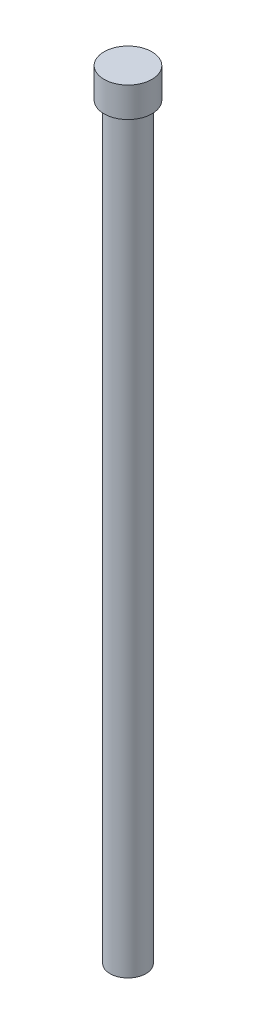
ISO-10303-21;
HEADER;
FILE_DESCRIPTION(('STEP AP214'),'2;1');
FILE_NAME('part.step','',(''),(''),'','','');
FILE_SCHEMA(('AUTOMOTIVE_DESIGN { 1 0 10303 214 1 1 1 1 }'));
ENDSEC;
DATA;
#1=APPLICATION_CONTEXT('core data for automotive mechanical design processes');
#2=APPLICATION_PROTOCOL_DEFINITION('international standard','automotive_design',2000,#1);
#3=PRODUCT_CONTEXT('',#1,'mechanical');
#4=PRODUCT('Part','Part','',(#3));
#5=PRODUCT_RELATED_PRODUCT_CATEGORY('part','',(#4));
#6=PRODUCT_DEFINITION_FORMATION('','',#4);
#7=PRODUCT_DEFINITION_CONTEXT('part definition',#1,'design');
#8=PRODUCT_DEFINITION('design','',#6,#7);
#9=PRODUCT_DEFINITION_SHAPE('','',#8);
#10=(LENGTH_UNIT() NAMED_UNIT(*) SI_UNIT(.MILLI.,.METRE.));
#11=(NAMED_UNIT(*) PLANE_ANGLE_UNIT() SI_UNIT($,.RADIAN.));
#12=(NAMED_UNIT(*) SI_UNIT($,.STERADIAN.) SOLID_ANGLE_UNIT());
#13=UNCERTAINTY_MEASURE_WITH_UNIT(LENGTH_MEASURE(1.E-05),#10,'distance_accuracy_value','');
#14=(GEOMETRIC_REPRESENTATION_CONTEXT(3) GLOBAL_UNCERTAINTY_ASSIGNED_CONTEXT((#13)) GLOBAL_UNIT_ASSIGNED_CONTEXT((#10,
#11,#12)) REPRESENTATION_CONTEXT('',''));
#15=CARTESIAN_POINT('',(0.,0.,0.));
#16=DIRECTION('',(0.,0.,1.));
#17=DIRECTION('',(1.,0.,0.));
#18=AXIS2_PLACEMENT_3D('',#15,#16,#17);
#19=CARTESIAN_POINT('',(0.,31.75,0.));
#20=DIRECTION('',(0.,-1.,0.));
#21=DIRECTION('',(0.,0.,-1.));
#22=AXIS2_PLACEMENT_3D('',#19,#20,#21);
#23=CYLINDRICAL_SURFACE('',#22,0.762);
#24=CARTESIAN_POINT('',(0.,31.75,0.));
#25=DIRECTION('',(0.,1.,0.));
#26=DIRECTION('',(0.,0.,1.));
#27=AXIS2_PLACEMENT_3D('',#24,#25,#26);
#28=CIRCLE('',#27,0.762);
#29=CARTESIAN_POINT('',(0.,31.75,0.762));
#30=VERTEX_POINT('',#29);
#31=EDGE_CURVE('E10',#30,#30,#28,.T.);
#32=ORIENTED_EDGE('',*,*,#31,.F.);
#33=EDGE_LOOP('',(#32));
#34=FACE_BOUND('',#33,.T.);
#35=CARTESIAN_POINT('',(0.,0.,0.));
#36=DIRECTION('',(0.,1.,0.));
#37=DIRECTION('',(0.,0.,1.));
#38=AXIS2_PLACEMENT_3D('',#35,#36,#37);
#39=CIRCLE('',#38,0.762);
#40=CARTESIAN_POINT('',(0.,0.,0.762));
#41=VERTEX_POINT('',#40);
#42=EDGE_CURVE('E36',#41,#41,#39,.T.);
#43=ORIENTED_EDGE('',*,*,#42,.T.);
#44=EDGE_LOOP('',(#43));
#45=FACE_BOUND('',#44,.T.);
#46=ADVANCED_FACE('F33',(#34,#45),#23,.T.);
#47=CARTESIAN_POINT('',(0.,0.,0.));
#48=DIRECTION('',(0.,1.,0.));
#49=DIRECTION('',(0.,0.,1.));
#50=AXIS2_PLACEMENT_3D('',#47,#48,#49);
#51=PLANE('',#50);
#52=ORIENTED_EDGE('',*,*,#42,.F.);
#53=EDGE_LOOP('',(#52));
#54=FACE_BOUND('',#53,.T.);
#55=ADVANCED_FACE('F56',(#54),#51,.F.);
#56=CARTESIAN_POINT('',(0.,33.02,0.));
#57=DIRECTION('',(0.,-1.,0.));
#58=DIRECTION('',(0.,0.,-1.));
#59=AXIS2_PLACEMENT_3D('',#56,#57,#58);
#60=CYLINDRICAL_SURFACE('',#59,1.016);
#61=CARTESIAN_POINT('',(0.,33.02,0.));
#62=DIRECTION('',(0.,1.,0.));
#63=DIRECTION('',(0.,0.,1.));
#64=AXIS2_PLACEMENT_3D('',#61,#62,#63);
#65=CIRCLE('',#64,1.016);
#66=CARTESIAN_POINT('',(0.,33.02,1.016));
#67=VERTEX_POINT('',#66);
#68=EDGE_CURVE('E43',#67,#67,#65,.T.);
#69=ORIENTED_EDGE('',*,*,#68,.F.);
#70=EDGE_LOOP('',(#69));
#71=FACE_BOUND('',#70,.T.);
#72=CARTESIAN_POINT('',(0.,31.75,0.));
#73=DIRECTION('',(0.,1.,0.));
#74=DIRECTION('',(0.,0.,1.));
#75=AXIS2_PLACEMENT_3D('',#72,#73,#74);
#76=CIRCLE('',#75,1.016);
#77=CARTESIAN_POINT('',(0.,31.75,1.016));
#78=VERTEX_POINT('',#77);
#79=EDGE_CURVE('E45',#78,#78,#76,.T.);
#80=ORIENTED_EDGE('',*,*,#79,.T.);
#81=EDGE_LOOP('',(#80));
#82=FACE_BOUND('',#81,.T.);
#83=ADVANCED_FACE('F53',(#71,#82),#60,.T.);
#84=CARTESIAN_POINT('',(0.,33.02,0.));
#85=DIRECTION('',(0.,1.,0.));
#86=DIRECTION('',(0.,0.,1.));
#87=AXIS2_PLACEMENT_3D('',#84,#85,#86);
#88=PLANE('',#87);
#89=ORIENTED_EDGE('',*,*,#68,.T.);
#90=EDGE_LOOP('',(#89));
#91=FACE_BOUND('',#90,.T.);
#92=ADVANCED_FACE('F51',(#91),#88,.T.);
#93=CARTESIAN_POINT('',(0.,31.75,0.));
#94=DIRECTION('',(0.,1.,0.));
#95=DIRECTION('',(0.,0.,1.));
#96=AXIS2_PLACEMENT_3D('',#93,#94,#95);
#97=PLANE('',#96);
#98=ORIENTED_EDGE('',*,*,#31,.T.);
#99=EDGE_LOOP('',(#98));
#100=FACE_BOUND('',#99,.T.);
#101=ORIENTED_EDGE('',*,*,#79,.F.);
#102=EDGE_LOOP('',(#101));
#103=FACE_BOUND('',#102,.T.);
#104=ADVANCED_FACE('F60',(#100,#103),#97,.F.);
#105=CLOSED_SHELL('',(#46,#55,#83,#92,#104));
#106=MANIFOLD_SOLID_BREP('B2',#105);
#107=ADVANCED_BREP_SHAPE_REPRESENTATION('',(#18,#106),#14);
#108=SHAPE_DEFINITION_REPRESENTATION(#9,#107);
ENDSEC;
END-ISO-10303-21;
